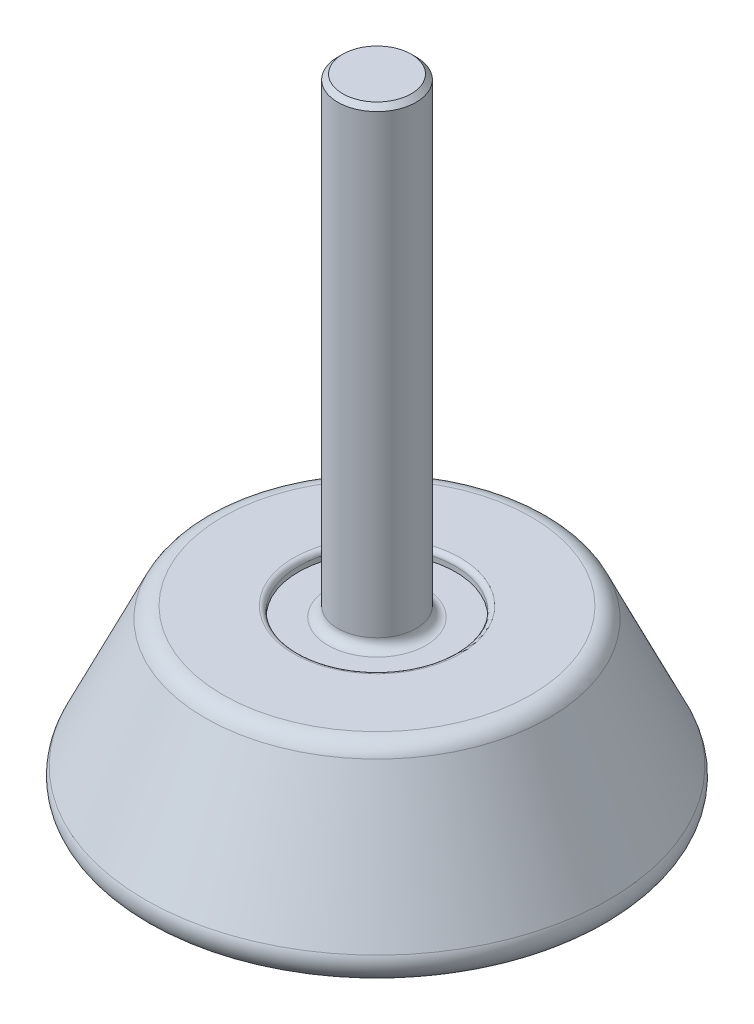
ISO-10303-21;
HEADER;
FILE_DESCRIPTION(('STEP AP214'),'2;1');
FILE_NAME('part.step','',(''),(''),'','','');
FILE_SCHEMA(('AUTOMOTIVE_DESIGN { 1 0 10303 214 1 1 1 1 }'));
ENDSEC;
DATA;
#1=APPLICATION_CONTEXT('core data for automotive mechanical design processes');
#2=APPLICATION_PROTOCOL_DEFINITION('international standard','automotive_design',2000,#1);
#3=PRODUCT_CONTEXT('',#1,'mechanical');
#4=PRODUCT('Part','Part','',(#3));
#5=PRODUCT_RELATED_PRODUCT_CATEGORY('part','',(#4));
#6=PRODUCT_DEFINITION_FORMATION('','',#4);
#7=PRODUCT_DEFINITION_CONTEXT('part definition',#1,'design');
#8=PRODUCT_DEFINITION('design','',#6,#7);
#9=PRODUCT_DEFINITION_SHAPE('','',#8);
#10=(LENGTH_UNIT() NAMED_UNIT(*) SI_UNIT(.MILLI.,.METRE.));
#11=(NAMED_UNIT(*) PLANE_ANGLE_UNIT() SI_UNIT($,.RADIAN.));
#12=(NAMED_UNIT(*) SI_UNIT($,.STERADIAN.) SOLID_ANGLE_UNIT());
#13=UNCERTAINTY_MEASURE_WITH_UNIT(LENGTH_MEASURE(1.E-05),#10,'distance_accuracy_value','');
#14=(GEOMETRIC_REPRESENTATION_CONTEXT(3) GLOBAL_UNCERTAINTY_ASSIGNED_CONTEXT((#13)) GLOBAL_UNIT_ASSIGNED_CONTEXT((#10,
#11,#12)) REPRESENTATION_CONTEXT('',''));
#15=CARTESIAN_POINT('',(0.,0.,0.));
#16=DIRECTION('',(0.,0.,1.));
#17=DIRECTION('',(1.,0.,0.));
#18=AXIS2_PLACEMENT_3D('',#15,#16,#17);
#19=CARTESIAN_POINT('',(0.,0.,0.));
#20=DIRECTION('',(0.,1.,0.));
#21=DIRECTION('',(0.,0.,1.));
#22=AXIS2_PLACEMENT_3D('',#19,#20,#21);
#23=PLANE('',#22);
#24=CARTESIAN_POINT('',(0.,0.,0.));
#25=DIRECTION('',(0.,1.,0.));
#26=DIRECTION('',(0.,0.,1.));
#27=AXIS2_PLACEMENT_3D('',#24,#25,#26);
#28=CIRCLE('',#27,21.8484359731699);
#29=CARTESIAN_POINT('',(0.,0.,21.8484359731699));
#30=VERTEX_POINT('',#29);
#31=EDGE_CURVE('E58',#30,#30,#28,.F.);
#32=ORIENTED_EDGE('',*,*,#31,.T.);
#33=EDGE_LOOP('',(#32));
#34=FACE_BOUND('',#33,.T.);
#35=ADVANCED_FACE('F32',(#34),#23,.F.);
#36=CARTESIAN_POINT('',(0.,0.,0.));
#37=DIRECTION('',(0.,-1.,0.));
#38=DIRECTION('',(0.,0.,-1.));
#39=AXIS2_PLACEMENT_3D('',#36,#37,#38);
#40=CONICAL_SURFACE('',#39,25.,0.439842582815736);
#41=CARTESIAN_POINT('',(0.,15.8515940726598,0.));
#42=DIRECTION('',(0.,1.,0.));
#43=DIRECTION('',(0.,0.,1.));
#44=AXIS2_PLACEMENT_3D('',#41,#42,#43);
#45=CIRCLE('',#44,17.5404263187484);
#46=CARTESIAN_POINT('',(0.,15.8515940726598,17.5404263187484));
#47=VERTEX_POINT('',#46);
#48=EDGE_CURVE('E61',#47,#47,#45,.F.);
#49=ORIENTED_EDGE('',*,*,#48,.T.);
#50=EDGE_LOOP('',(#49));
#51=FACE_BOUND('',#50,.T.);
#52=CARTESIAN_POINT('',(0.,2.85159407265975,0.));
#53=DIRECTION('',(0.,1.,0.));
#54=DIRECTION('',(0.,0.,1.));
#55=AXIS2_PLACEMENT_3D('',#52,#53,#54);
#56=CIRCLE('',#55,23.6580733775719);
#57=CARTESIAN_POINT('',(0.,2.85159407265975,23.6580733775719));
#58=VERTEX_POINT('',#57);
#59=EDGE_CURVE('E64',#58,#58,#56,.T.);
#60=ORIENTED_EDGE('',*,*,#59,.T.);
#61=EDGE_LOOP('',(#60));
#62=FACE_BOUND('',#61,.T.);
#63=ADVANCED_FACE('F88',(#51,#62),#40,.T.);
#64=CARTESIAN_POINT('',(17.,17.,0.));
#65=DIRECTION('',(0.,-1.,0.));
#66=DIRECTION('',(0.,0.,-1.));
#67=AXIS2_PLACEMENT_3D('',#64,#65,#66);
#68=PLANE('',#67);
#69=CARTESIAN_POINT('',(0.,17.,0.));
#70=DIRECTION('',(0.,-1.,0.));
#71=DIRECTION('',(0.,0.,-1.));
#72=AXIS2_PLACEMENT_3D('',#69,#70,#71);
#73=CIRCLE('',#72,8.5);
#74=CARTESIAN_POINT('',(0.,17.,-8.5));
#75=VERTEX_POINT('',#74);
#76=EDGE_CURVE('E43',#75,#75,#73,.T.);
#77=ORIENTED_EDGE('',*,*,#76,.T.);
#78=EDGE_LOOP('',(#77));
#79=FACE_BOUND('',#78,.T.);
#80=CARTESIAN_POINT('',(0.,17.,0.));
#81=DIRECTION('',(0.,-1.,0.));
#82=DIRECTION('',(0.,0.,-1.));
#83=AXIS2_PLACEMENT_3D('',#80,#81,#82);
#84=CIRCLE('',#83,15.7307889143464);
#85=CARTESIAN_POINT('',(0.,17.,-15.7307889143464));
#86=VERTEX_POINT('',#85);
#87=EDGE_CURVE('E67',#86,#86,#84,.F.);
#88=ORIENTED_EDGE('',*,*,#87,.T.);
#89=EDGE_LOOP('',(#88));
#90=FACE_BOUND('',#89,.T.);
#91=ADVANCED_FACE('F78',(#79,#90),#68,.F.);
#92=CARTESIAN_POINT('',(0.,64.,0.));
#93=DIRECTION('',(0.,1.,0.));
#94=DIRECTION('',(0.,0.,1.));
#95=AXIS2_PLACEMENT_3D('',#92,#93,#94);
#96=CYLINDRICAL_SURFACE('',#95,8.);
#97=CARTESIAN_POINT('',(0.,16.5,0.));
#98=DIRECTION('',(0.,-1.,0.));
#99=DIRECTION('',(0.,0.,-1.));
#100=AXIS2_PLACEMENT_3D('',#97,#98,#99);
#101=CIRCLE('',#100,8.);
#102=CARTESIAN_POINT('',(0.,16.5,-8.));
#103=VERTEX_POINT('',#102);
#104=EDGE_CURVE('E47',#103,#103,#101,.F.);
#105=ORIENTED_EDGE('',*,*,#104,.T.);
#106=EDGE_LOOP('',(#105));
#107=FACE_BOUND('',#106,.T.);
#108=CARTESIAN_POINT('',(0.,16.,0.));
#109=DIRECTION('',(0.,1.,0.));
#110=DIRECTION('',(0.,0.,1.));
#111=AXIS2_PLACEMENT_3D('',#108,#109,#110);
#112=CIRCLE('',#111,8.);
#113=CARTESIAN_POINT('',(0.,16.,8.));
#114=VERTEX_POINT('',#113);
#115=EDGE_CURVE('E70',#114,#114,#112,.T.);
#116=ORIENTED_EDGE('',*,*,#115,.F.);
#117=EDGE_LOOP('',(#116));
#118=FACE_BOUND('',#117,.T.);
#119=ADVANCED_FACE('F76',(#107,#118),#96,.F.);
#120=CARTESIAN_POINT('',(8.,16.,0.));
#121=DIRECTION('',(0.,-1.,0.));
#122=DIRECTION('',(0.,0.,-1.));
#123=AXIS2_PLACEMENT_3D('',#120,#121,#122);
#124=PLANE('',#123);
#125=CARTESIAN_POINT('',(0.,16.,0.));
#126=DIRECTION('',(0.,-1.,0.));
#127=DIRECTION('',(0.,0.,-1.));
#128=AXIS2_PLACEMENT_3D('',#125,#126,#127);
#129=CIRCLE('',#128,5.);
#130=CARTESIAN_POINT('',(0.,16.,-5.));
#131=VERTEX_POINT('',#130);
#132=EDGE_CURVE('E52',#131,#131,#129,.T.);
#133=ORIENTED_EDGE('',*,*,#132,.T.);
#134=EDGE_LOOP('',(#133));
#135=FACE_BOUND('',#134,.T.);
#136=ORIENTED_EDGE('',*,*,#115,.T.);
#137=EDGE_LOOP('',(#136));
#138=FACE_BOUND('',#137,.T.);
#139=ADVANCED_FACE('F74',(#135,#138),#124,.F.);
#140=CARTESIAN_POINT('',(0.,64.,0.));
#141=DIRECTION('',(0.,1.,0.));
#142=DIRECTION('',(0.,0.,1.));
#143=AXIS2_PLACEMENT_3D('',#140,#141,#142);
#144=CYLINDRICAL_SURFACE('',#143,4.);
#145=CARTESIAN_POINT('',(0.,63.5,0.));
#146=DIRECTION('',(0.,-1.,0.));
#147=DIRECTION('',(0.,0.,-1.));
#148=AXIS2_PLACEMENT_3D('',#145,#146,#147);
#149=CIRCLE('',#148,4.);
#150=CARTESIAN_POINT('',(0.,63.5,-4.));
#151=VERTEX_POINT('',#150);
#152=EDGE_CURVE('E10',#151,#151,#149,.T.);
#153=ORIENTED_EDGE('',*,*,#152,.T.);
#154=EDGE_LOOP('',(#153));
#155=FACE_BOUND('',#154,.T.);
#156=CARTESIAN_POINT('',(0.,17.,0.));
#157=DIRECTION('',(0.,-1.,0.));
#158=DIRECTION('',(0.,0.,-1.));
#159=AXIS2_PLACEMENT_3D('',#156,#157,#158);
#160=CIRCLE('',#159,4.);
#161=CARTESIAN_POINT('',(0.,17.,-4.));
#162=VERTEX_POINT('',#161);
#163=EDGE_CURVE('E55',#162,#162,#160,.F.);
#164=ORIENTED_EDGE('',*,*,#163,.T.);
#165=EDGE_LOOP('',(#164));
#166=FACE_BOUND('',#165,.T.);
#167=ADVANCED_FACE('F85',(#155,#166),#144,.T.);
#168=CARTESIAN_POINT('',(4.,64.,0.));
#169=DIRECTION('',(0.,-1.,0.));
#170=DIRECTION('',(0.,0.,-1.));
#171=AXIS2_PLACEMENT_3D('',#168,#169,#170);
#172=PLANE('',#171);
#173=CARTESIAN_POINT('',(0.,64.,0.));
#174=DIRECTION('',(0.,-1.,0.));
#175=DIRECTION('',(0.,0.,-1.));
#176=AXIS2_PLACEMENT_3D('',#173,#174,#175);
#177=CIRCLE('',#176,3.5);
#178=CARTESIAN_POINT('',(0.,64.,-3.5));
#179=VERTEX_POINT('',#178);
#180=EDGE_CURVE('E39',#179,#179,#177,.F.);
#181=ORIENTED_EDGE('',*,*,#180,.T.);
#182=EDGE_LOOP('',(#181));
#183=FACE_BOUND('',#182,.T.);
#184=ADVANCED_FACE('F104',(#183),#172,.F.);
#185=CARTESIAN_POINT('',(0.,15.,0.));
#186=DIRECTION('',(0.,-1.,0.));
#187=DIRECTION('',(0.,0.,-1.));
#188=AXIS2_PLACEMENT_3D('',#185,#186,#187);
#189=TOROIDAL_SURFACE('',#188,15.7307889143464,2.);
#190=ORIENTED_EDGE('',*,*,#48,.F.);
#191=EDGE_LOOP('',(#190));
#192=FACE_BOUND('',#191,.T.);
#193=ORIENTED_EDGE('',*,*,#87,.F.);
#194=EDGE_LOOP('',(#193));
#195=FACE_BOUND('',#194,.T.);
#196=ADVANCED_FACE('F100',(#192,#195),#189,.T.);
#197=CARTESIAN_POINT('',(0.,2.,0.));
#198=DIRECTION('',(0.,1.,0.));
#199=DIRECTION('',(0.,0.,1.));
#200=AXIS2_PLACEMENT_3D('',#197,#198,#199);
#201=TOROIDAL_SURFACE('',#200,21.8484359731699,2.);
#202=ORIENTED_EDGE('',*,*,#31,.F.);
#203=EDGE_LOOP('',(#202));
#204=FACE_BOUND('',#203,.T.);
#205=ORIENTED_EDGE('',*,*,#59,.F.);
#206=EDGE_LOOP('',(#205));
#207=FACE_BOUND('',#206,.T.);
#208=ADVANCED_FACE('F103',(#204,#207),#201,.T.);
#209=CARTESIAN_POINT('',(0.,17.,0.));
#210=DIRECTION('',(0.,-1.,0.));
#211=DIRECTION('',(0.,0.,-1.));
#212=AXIS2_PLACEMENT_3D('',#209,#210,#211);
#213=TOROIDAL_SURFACE('',#212,5.,1.);
#214=ORIENTED_EDGE('',*,*,#132,.F.);
#215=EDGE_LOOP('',(#214));
#216=FACE_BOUND('',#215,.T.);
#217=ORIENTED_EDGE('',*,*,#163,.F.);
#218=EDGE_LOOP('',(#217));
#219=FACE_BOUND('',#218,.T.);
#220=ADVANCED_FACE('F108',(#216,#219),#213,.F.);
#221=CARTESIAN_POINT('',(0.,16.5,0.));
#222=DIRECTION('',(0.,-1.,0.));
#223=DIRECTION('',(0.,0.,-1.));
#224=AXIS2_PLACEMENT_3D('',#221,#222,#223);
#225=TOROIDAL_SURFACE('',#224,8.5,0.5);
#226=ORIENTED_EDGE('',*,*,#76,.F.);
#227=EDGE_LOOP('',(#226));
#228=FACE_BOUND('',#227,.T.);
#229=ORIENTED_EDGE('',*,*,#104,.F.);
#230=EDGE_LOOP('',(#229));
#231=FACE_BOUND('',#230,.T.);
#232=ADVANCED_FACE('F111',(#228,#231),#225,.T.);
#233=CARTESIAN_POINT('',(0.,64.,0.));
#234=DIRECTION('',(0.,-1.,0.));
#235=DIRECTION('',(0.,0.,-1.));
#236=AXIS2_PLACEMENT_3D('',#233,#234,#235);
#237=CONICAL_SURFACE('',#236,3.5,0.785398163397445);
#238=ORIENTED_EDGE('',*,*,#152,.F.);
#239=EDGE_LOOP('',(#238));
#240=FACE_BOUND('',#239,.T.);
#241=ORIENTED_EDGE('',*,*,#180,.F.);
#242=EDGE_LOOP('',(#241));
#243=FACE_BOUND('',#242,.T.);
#244=ADVANCED_FACE('F34',(#240,#243),#237,.T.);
#245=CLOSED_SHELL('',(#35,#63,#91,#119,#139,#167,#184,#196,#208,#220,#232,#244));
#246=MANIFOLD_SOLID_BREP('B2',#245);
#247=ADVANCED_BREP_SHAPE_REPRESENTATION('',(#18,#246),#14);
#248=SHAPE_DEFINITION_REPRESENTATION(#9,#247);
ENDSEC;
END-ISO-10303-21;
